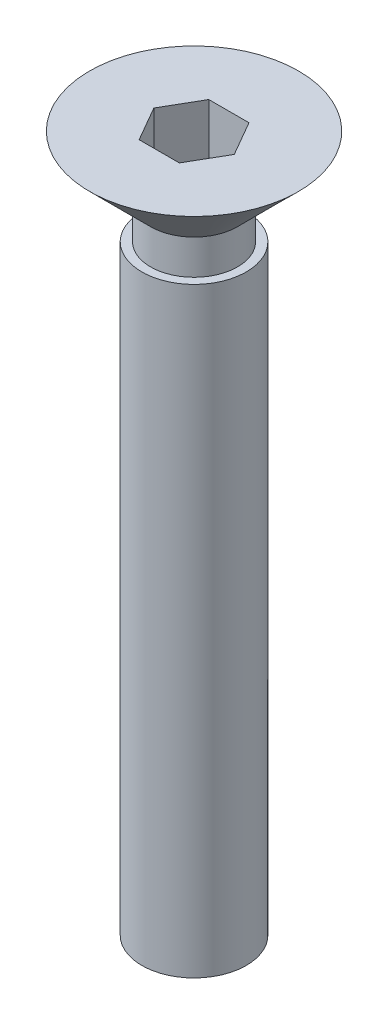
ISO-10303-21;
HEADER;
FILE_DESCRIPTION(('STEP AP214'),'2;1');
FILE_NAME('part.step','',(''),(''),'','','');
FILE_SCHEMA(('AUTOMOTIVE_DESIGN { 1 0 10303 214 1 1 1 1 }'));
ENDSEC;
DATA;
#1=APPLICATION_CONTEXT('core data for automotive mechanical design processes');
#2=APPLICATION_PROTOCOL_DEFINITION('international standard','automotive_design',2000,#1);
#3=PRODUCT_CONTEXT('',#1,'mechanical');
#4=PRODUCT('Part','Part','',(#3));
#5=PRODUCT_RELATED_PRODUCT_CATEGORY('part','',(#4));
#6=PRODUCT_DEFINITION_FORMATION('','',#4);
#7=PRODUCT_DEFINITION_CONTEXT('part definition',#1,'design');
#8=PRODUCT_DEFINITION('design','',#6,#7);
#9=PRODUCT_DEFINITION_SHAPE('','',#8);
#10=(LENGTH_UNIT() NAMED_UNIT(*) SI_UNIT(.MILLI.,.METRE.));
#11=(NAMED_UNIT(*) PLANE_ANGLE_UNIT() SI_UNIT($,.RADIAN.));
#12=(NAMED_UNIT(*) SI_UNIT($,.STERADIAN.) SOLID_ANGLE_UNIT());
#13=UNCERTAINTY_MEASURE_WITH_UNIT(LENGTH_MEASURE(1.E-05),#10,'distance_accuracy_value','');
#14=(GEOMETRIC_REPRESENTATION_CONTEXT(3) GLOBAL_UNCERTAINTY_ASSIGNED_CONTEXT((#13)) GLOBAL_UNIT_ASSIGNED_CONTEXT((#10,
#11,#12)) REPRESENTATION_CONTEXT('',''));
#15=CARTESIAN_POINT('',(0.,0.,0.));
#16=DIRECTION('',(0.,0.,1.));
#17=DIRECTION('',(1.,0.,0.));
#18=AXIS2_PLACEMENT_3D('',#15,#16,#17);
#19=CARTESIAN_POINT('',(0.,20.,0.));
#20=DIRECTION('',(0.,-1.,0.));
#21=DIRECTION('',(0.,0.,-1.));
#22=AXIS2_PLACEMENT_3D('',#19,#20,#21);
#23=PLANE('',#22);
#24=DIRECTION('',(-1.,0.,0.));
#25=VECTOR('',#24,1.);
#26=CARTESIAN_POINT('',(0.577350269189625,20.,-1.));
#27=LINE('',#26,#25);
#28=CARTESIAN_POINT('',(0.577350269189625,20.,-1.));
#29=VERTEX_POINT('',#28);
#30=CARTESIAN_POINT('',(-0.577350269189626,20.,-1.));
#31=VERTEX_POINT('',#30);
#32=EDGE_CURVE('E124',#29,#31,#27,.T.);
#33=ORIENTED_EDGE('',*,*,#32,.F.);
#34=DIRECTION('',(-0.5,0.,-0.866025403784438));
#35=VECTOR('',#34,1.);
#36=CARTESIAN_POINT('',(1.15470053837925,20.,0.));
#37=LINE('',#36,#35);
#38=CARTESIAN_POINT('',(1.15470053837925,20.,0.));
#39=VERTEX_POINT('',#38);
#40=EDGE_CURVE('E50',#39,#29,#37,.T.);
#41=ORIENTED_EDGE('',*,*,#40,.F.);
#42=DIRECTION('',(0.5,0.,-0.866025403784439));
#43=VECTOR('',#42,1.);
#44=CARTESIAN_POINT('',(0.577350269189626,20.,1.));
#45=LINE('',#44,#43);
#46=CARTESIAN_POINT('',(0.577350269189626,20.,1.));
#47=VERTEX_POINT('',#46);
#48=EDGE_CURVE('E133',#47,#39,#45,.T.);
#49=ORIENTED_EDGE('',*,*,#48,.F.);
#50=DIRECTION('',(1.,0.,0.));
#51=VECTOR('',#50,1.);
#52=CARTESIAN_POINT('',(-0.577350269189626,20.,1.));
#53=LINE('',#52,#51);
#54=CARTESIAN_POINT('',(-0.577350269189626,20.,1.));
#55=VERTEX_POINT('',#54);
#56=EDGE_CURVE('E131',#55,#47,#53,.T.);
#57=ORIENTED_EDGE('',*,*,#56,.F.);
#58=DIRECTION('',(0.5,0.,0.866025403784439));
#59=VECTOR('',#58,1.);
#60=CARTESIAN_POINT('',(-1.15470053837925,20.,0.));
#61=LINE('',#60,#59);
#62=CARTESIAN_POINT('',(-1.15470053837925,20.,0.));
#63=VERTEX_POINT('',#62);
#64=EDGE_CURVE('E98',#63,#55,#61,.T.);
#65=ORIENTED_EDGE('',*,*,#64,.F.);
#66=DIRECTION('',(-0.5,0.,0.866025403784438));
#67=VECTOR('',#66,1.);
#68=CARTESIAN_POINT('',(-0.577350269189626,20.,-1.));
#69=LINE('',#68,#67);
#70=EDGE_CURVE('E127',#31,#63,#69,.T.);
#71=ORIENTED_EDGE('',*,*,#70,.F.);
#72=EDGE_LOOP('',(#33,#41,#49,#57,#65,#71));
#73=FACE_BOUND('',#72,.T.);
#74=CARTESIAN_POINT('',(0.,20.,0.));
#75=DIRECTION('',(0.,-1.,0.));
#76=DIRECTION('',(0.,0.,-1.));
#77=AXIS2_PLACEMENT_3D('',#74,#75,#76);
#78=CIRCLE('',#77,3.);
#79=CARTESIAN_POINT('',(0.,20.,-3.));
#80=VERTEX_POINT('',#79);
#81=EDGE_CURVE('E11',#80,#80,#78,.T.);
#82=ORIENTED_EDGE('',*,*,#81,.F.);
#83=EDGE_LOOP('',(#82));
#84=FACE_BOUND('',#83,.T.);
#85=ADVANCED_FACE('F36',(#73,#84),#23,.F.);
#86=CARTESIAN_POINT('',(0.,20.,0.));
#87=DIRECTION('',(0.,1.,0.));
#88=DIRECTION('',(0.,0.,1.));
#89=AXIS2_PLACEMENT_3D('',#86,#87,#88);
#90=CONICAL_SURFACE('',#89,3.,0.785398163397453);
#91=CARTESIAN_POINT('',(0.,18.25,0.));
#92=DIRECTION('',(0.,-1.,0.));
#93=DIRECTION('',(0.,0.,-1.));
#94=AXIS2_PLACEMENT_3D('',#91,#92,#93);
#95=CIRCLE('',#94,1.25);
#96=CARTESIAN_POINT('',(0.,18.25,-1.25));
#97=VERTEX_POINT('',#96);
#98=EDGE_CURVE('E43',#97,#97,#95,.T.);
#99=ORIENTED_EDGE('',*,*,#98,.F.);
#100=EDGE_LOOP('',(#99));
#101=FACE_BOUND('',#100,.T.);
#102=ORIENTED_EDGE('',*,*,#81,.T.);
#103=EDGE_LOOP('',(#102));
#104=FACE_BOUND('',#103,.T.);
#105=ADVANCED_FACE('F155',(#101,#104),#90,.T.);
#106=CARTESIAN_POINT('',(0.,0.,0.));
#107=DIRECTION('',(0.,-1.,0.));
#108=DIRECTION('',(0.,0.,-1.));
#109=AXIS2_PLACEMENT_3D('',#106,#107,#108);
#110=CYLINDRICAL_SURFACE('',#109,1.25);
#111=CARTESIAN_POINT('',(0.,17.25,0.));
#112=DIRECTION('',(0.,-1.,0.));
#113=DIRECTION('',(0.,0.,-1.));
#114=AXIS2_PLACEMENT_3D('',#111,#112,#113);
#115=CIRCLE('',#114,1.25);
#116=CARTESIAN_POINT('',(0.,17.25,-1.25));
#117=VERTEX_POINT('',#116);
#118=EDGE_CURVE('E148',#117,#117,#115,.T.);
#119=ORIENTED_EDGE('',*,*,#118,.F.);
#120=EDGE_LOOP('',(#119));
#121=FACE_BOUND('',#120,.T.);
#122=ORIENTED_EDGE('',*,*,#98,.T.);
#123=EDGE_LOOP('',(#122));
#124=FACE_BOUND('',#123,.T.);
#125=ADVANCED_FACE('F153',(#121,#124),#110,.T.);
#126=CARTESIAN_POINT('',(-1.25,17.25,0.));
#127=DIRECTION('',(0.,-1.,0.));
#128=DIRECTION('',(0.,0.,-1.));
#129=AXIS2_PLACEMENT_3D('',#126,#127,#128);
#130=PLANE('',#129);
#131=CARTESIAN_POINT('',(0.,17.25,0.));
#132=DIRECTION('',(0.,-1.,0.));
#133=DIRECTION('',(0.,0.,-1.));
#134=AXIS2_PLACEMENT_3D('',#131,#132,#133);
#135=CIRCLE('',#134,1.5);
#136=CARTESIAN_POINT('',(0.,17.25,-1.5));
#137=VERTEX_POINT('',#136);
#138=EDGE_CURVE('E145',#137,#137,#135,.T.);
#139=ORIENTED_EDGE('',*,*,#138,.F.);
#140=EDGE_LOOP('',(#139));
#141=FACE_BOUND('',#140,.T.);
#142=ORIENTED_EDGE('',*,*,#118,.T.);
#143=EDGE_LOOP('',(#142));
#144=FACE_BOUND('',#143,.T.);
#145=ADVANCED_FACE('F188',(#141,#144),#130,.F.);
#146=CARTESIAN_POINT('',(0.,0.,0.));
#147=DIRECTION('',(0.,-1.,0.));
#148=DIRECTION('',(0.,0.,-1.));
#149=AXIS2_PLACEMENT_3D('',#146,#147,#148);
#150=CYLINDRICAL_SURFACE('',#149,1.5);
#151=CARTESIAN_POINT('',(0.,0.,0.));
#152=DIRECTION('',(0.,-1.,0.));
#153=DIRECTION('',(0.,0.,-1.));
#154=AXIS2_PLACEMENT_3D('',#151,#152,#153);
#155=CIRCLE('',#154,1.5);
#156=CARTESIAN_POINT('',(0.,0.,-1.5));
#157=VERTEX_POINT('',#156);
#158=EDGE_CURVE('E137',#157,#157,#155,.T.);
#159=ORIENTED_EDGE('',*,*,#158,.F.);
#160=EDGE_LOOP('',(#159));
#161=FACE_BOUND('',#160,.T.);
#162=ORIENTED_EDGE('',*,*,#138,.T.);
#163=EDGE_LOOP('',(#162));
#164=FACE_BOUND('',#163,.T.);
#165=ADVANCED_FACE('F180',(#161,#164),#150,.T.);
#166=CARTESIAN_POINT('',(-1.5,0.,0.));
#167=DIRECTION('',(0.,1.,0.));
#168=DIRECTION('',(0.,0.,1.));
#169=AXIS2_PLACEMENT_3D('',#166,#167,#168);
#170=PLANE('',#169);
#171=ORIENTED_EDGE('',*,*,#158,.T.);
#172=EDGE_LOOP('',(#171));
#173=FACE_BOUND('',#172,.T.);
#174=ADVANCED_FACE('F173',(#173),#170,.F.);
#175=CARTESIAN_POINT('',(1.15470053837925,18.,0.));
#176=DIRECTION('',(0.866025403784439,0.,-0.5));
#177=DIRECTION('',(-0.5,0.,-0.866025403784438));
#178=AXIS2_PLACEMENT_3D('',#175,#176,#177);
#179=PLANE('',#178);
#180=ORIENTED_EDGE('',*,*,#40,.T.);
#181=DIRECTION('',(0.,1.,0.));
#182=VECTOR('',#181,1.);
#183=CARTESIAN_POINT('',(0.577350269189625,18.,-1.));
#184=LINE('',#183,#182);
#185=CARTESIAN_POINT('',(0.577350269189625,18.,-1.));
#186=VERTEX_POINT('',#185);
#187=EDGE_CURVE('E80',#186,#29,#184,.T.);
#188=ORIENTED_EDGE('',*,*,#187,.F.);
#189=DIRECTION('',(-0.5,0.,-0.866025403784438));
#190=VECTOR('',#189,1.);
#191=CARTESIAN_POINT('',(1.15470053837925,18.,0.));
#192=LINE('',#191,#190);
#193=CARTESIAN_POINT('',(1.15470053837925,18.,0.));
#194=VERTEX_POINT('',#193);
#195=EDGE_CURVE('E135',#194,#186,#192,.T.);
#196=ORIENTED_EDGE('',*,*,#195,.F.);
#197=DIRECTION('',(0.,1.,0.));
#198=VECTOR('',#197,1.);
#199=CARTESIAN_POINT('',(1.15470053837925,18.,0.));
#200=LINE('',#199,#198);
#201=EDGE_CURVE('E58',#194,#39,#200,.T.);
#202=ORIENTED_EDGE('',*,*,#201,.T.);
#203=EDGE_LOOP('',(#180,#188,#196,#202));
#204=FACE_BOUND('',#203,.T.);
#205=ADVANCED_FACE('F170',(#204),#179,.F.);
#206=CARTESIAN_POINT('',(0.577350269189626,18.,1.));
#207=DIRECTION('',(0.866025403784439,0.,0.5));
#208=DIRECTION('',(0.5,0.,-0.866025403784439));
#209=AXIS2_PLACEMENT_3D('',#206,#207,#208);
#210=PLANE('',#209);
#211=ORIENTED_EDGE('',*,*,#48,.T.);
#212=ORIENTED_EDGE('',*,*,#201,.F.);
#213=DIRECTION('',(0.5,0.,-0.866025403784439));
#214=VECTOR('',#213,1.);
#215=CARTESIAN_POINT('',(0.577350269189626,18.,1.));
#216=LINE('',#215,#214);
#217=CARTESIAN_POINT('',(0.577350269189626,18.,1.));
#218=VERTEX_POINT('',#217);
#219=EDGE_CURVE('E110',#218,#194,#216,.T.);
#220=ORIENTED_EDGE('',*,*,#219,.F.);
#221=DIRECTION('',(0.,1.,0.));
#222=VECTOR('',#221,1.);
#223=CARTESIAN_POINT('',(0.577350269189626,18.,1.));
#224=LINE('',#223,#222);
#225=EDGE_CURVE('E102',#218,#47,#224,.T.);
#226=ORIENTED_EDGE('',*,*,#225,.T.);
#227=EDGE_LOOP('',(#211,#212,#220,#226));
#228=FACE_BOUND('',#227,.T.);
#229=ADVANCED_FACE('F172',(#228),#210,.F.);
#230=CARTESIAN_POINT('',(-0.577350269189626,18.,1.));
#231=DIRECTION('',(0.,0.,1.));
#232=DIRECTION('',(1.,0.,0.));
#233=AXIS2_PLACEMENT_3D('',#230,#231,#232);
#234=PLANE('',#233);
#235=ORIENTED_EDGE('',*,*,#56,.T.);
#236=ORIENTED_EDGE('',*,*,#225,.F.);
#237=DIRECTION('',(1.,0.,0.));
#238=VECTOR('',#237,1.);
#239=CARTESIAN_POINT('',(-0.577350269189626,18.,1.));
#240=LINE('',#239,#238);
#241=CARTESIAN_POINT('',(-0.577350269189626,18.,1.));
#242=VERTEX_POINT('',#241);
#243=EDGE_CURVE('E106',#242,#218,#240,.T.);
#244=ORIENTED_EDGE('',*,*,#243,.F.);
#245=DIRECTION('',(0.,1.,0.));
#246=VECTOR('',#245,1.);
#247=CARTESIAN_POINT('',(-0.577350269189626,18.,1.));
#248=LINE('',#247,#246);
#249=EDGE_CURVE('E91',#242,#55,#248,.T.);
#250=ORIENTED_EDGE('',*,*,#249,.T.);
#251=EDGE_LOOP('',(#235,#236,#244,#250));
#252=FACE_BOUND('',#251,.T.);
#253=ADVANCED_FACE('F107',(#252),#234,.F.);
#254=CARTESIAN_POINT('',(-1.15470053837925,18.,0.));
#255=DIRECTION('',(-0.866025403784439,0.,0.5));
#256=DIRECTION('',(0.5,0.,0.866025403784439));
#257=AXIS2_PLACEMENT_3D('',#254,#255,#256);
#258=PLANE('',#257);
#259=ORIENTED_EDGE('',*,*,#64,.T.);
#260=ORIENTED_EDGE('',*,*,#249,.F.);
#261=DIRECTION('',(0.5,0.,0.866025403784439));
#262=VECTOR('',#261,1.);
#263=CARTESIAN_POINT('',(-1.15470053837925,18.,0.));
#264=LINE('',#263,#262);
#265=CARTESIAN_POINT('',(-1.15470053837925,18.,0.));
#266=VERTEX_POINT('',#265);
#267=EDGE_CURVE('E95',#266,#242,#264,.T.);
#268=ORIENTED_EDGE('',*,*,#267,.F.);
#269=DIRECTION('',(0.,1.,0.));
#270=VECTOR('',#269,1.);
#271=CARTESIAN_POINT('',(-1.15470053837925,18.,0.));
#272=LINE('',#271,#270);
#273=EDGE_CURVE('E103',#266,#63,#272,.T.);
#274=ORIENTED_EDGE('',*,*,#273,.T.);
#275=EDGE_LOOP('',(#259,#260,#268,#274));
#276=FACE_BOUND('',#275,.T.);
#277=ADVANCED_FACE('F93',(#276),#258,.F.);
#278=CARTESIAN_POINT('',(-0.577350269189626,18.,-1.));
#279=DIRECTION('',(-0.866025403784439,0.,-0.5));
#280=DIRECTION('',(-0.5,0.,0.866025403784439));
#281=AXIS2_PLACEMENT_3D('',#278,#279,#280);
#282=PLANE('',#281);
#283=ORIENTED_EDGE('',*,*,#70,.T.);
#284=ORIENTED_EDGE('',*,*,#273,.F.);
#285=DIRECTION('',(-0.5,0.,0.866025403784438));
#286=VECTOR('',#285,1.);
#287=CARTESIAN_POINT('',(-0.577350269189626,18.,-1.));
#288=LINE('',#287,#286);
#289=CARTESIAN_POINT('',(-0.577350269189626,18.,-1.));
#290=VERTEX_POINT('',#289);
#291=EDGE_CURVE('E116',#290,#266,#288,.T.);
#292=ORIENTED_EDGE('',*,*,#291,.F.);
#293=DIRECTION('',(0.,1.,0.));
#294=VECTOR('',#293,1.);
#295=CARTESIAN_POINT('',(-0.577350269189626,18.,-1.));
#296=LINE('',#295,#294);
#297=EDGE_CURVE('E140',#290,#31,#296,.T.);
#298=ORIENTED_EDGE('',*,*,#297,.T.);
#299=EDGE_LOOP('',(#283,#284,#292,#298));
#300=FACE_BOUND('',#299,.T.);
#301=ADVANCED_FACE('F247',(#300),#282,.F.);
#302=CARTESIAN_POINT('',(0.577350269189625,18.,-1.));
#303=DIRECTION('',(0.,0.,-1.));
#304=DIRECTION('',(-1.,0.,0.));
#305=AXIS2_PLACEMENT_3D('',#302,#303,#304);
#306=PLANE('',#305);
#307=ORIENTED_EDGE('',*,*,#32,.T.);
#308=ORIENTED_EDGE('',*,*,#297,.F.);
#309=DIRECTION('',(-1.,0.,0.));
#310=VECTOR('',#309,1.);
#311=CARTESIAN_POINT('',(0.577350269189625,18.,-1.));
#312=LINE('',#311,#310);
#313=EDGE_CURVE('E118',#186,#290,#312,.T.);
#314=ORIENTED_EDGE('',*,*,#313,.F.);
#315=ORIENTED_EDGE('',*,*,#187,.T.);
#316=EDGE_LOOP('',(#307,#308,#314,#315));
#317=FACE_BOUND('',#316,.T.);
#318=ADVANCED_FACE('F168',(#317),#306,.F.);
#319=CARTESIAN_POINT('',(0.,18.,0.));
#320=DIRECTION('',(0.,1.,0.));
#321=DIRECTION('',(0.,0.,1.));
#322=AXIS2_PLACEMENT_3D('',#319,#320,#321);
#323=PLANE('',#322);
#324=ORIENTED_EDGE('',*,*,#195,.T.);
#325=ORIENTED_EDGE('',*,*,#313,.T.);
#326=ORIENTED_EDGE('',*,*,#291,.T.);
#327=ORIENTED_EDGE('',*,*,#267,.T.);
#328=ORIENTED_EDGE('',*,*,#243,.T.);
#329=ORIENTED_EDGE('',*,*,#219,.T.);
#330=EDGE_LOOP('',(#324,#325,#326,#327,#328,#329));
#331=FACE_BOUND('',#330,.T.);
#332=ADVANCED_FACE('F113',(#331),#323,.T.);
#333=CLOSED_SHELL('',(#85,#105,#125,#145,#165,#174,#205,#229,#253,#277,#301,#318,#332));
#334=MANIFOLD_SOLID_BREP('B2',#333);
#335=ADVANCED_BREP_SHAPE_REPRESENTATION('',(#18,#334),#14);
#336=SHAPE_DEFINITION_REPRESENTATION(#9,#335);
ENDSEC;
END-ISO-10303-21;
